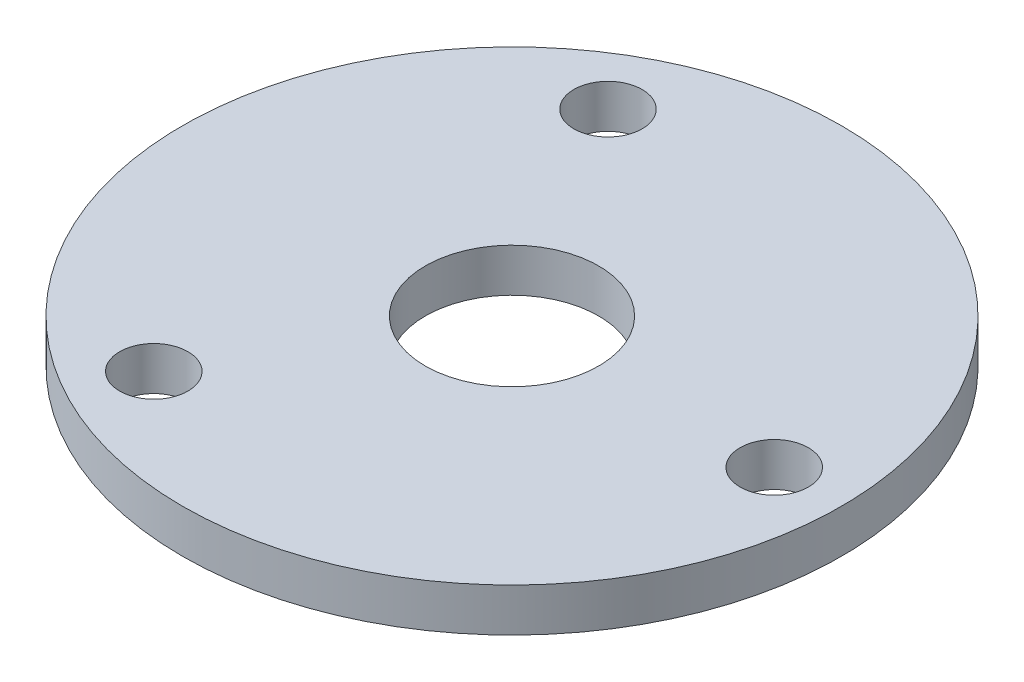
ISO-10303-21;
HEADER;
FILE_DESCRIPTION(('STEP AP214'),'2;1');
FILE_NAME('part.step','',(''),(''),'','','');
FILE_SCHEMA(('AUTOMOTIVE_DESIGN { 1 0 10303 214 1 1 1 1 }'));
ENDSEC;
DATA;
#1=APPLICATION_CONTEXT('core data for automotive mechanical design processes');
#2=APPLICATION_PROTOCOL_DEFINITION('international standard','automotive_design',2000,#1);
#3=PRODUCT_CONTEXT('',#1,'mechanical');
#4=PRODUCT('Part','Part','',(#3));
#5=PRODUCT_RELATED_PRODUCT_CATEGORY('part','',(#4));
#6=PRODUCT_DEFINITION_FORMATION('','',#4);
#7=PRODUCT_DEFINITION_CONTEXT('part definition',#1,'design');
#8=PRODUCT_DEFINITION('design','',#6,#7);
#9=PRODUCT_DEFINITION_SHAPE('','',#8);
#10=(LENGTH_UNIT() NAMED_UNIT(*) SI_UNIT(.MILLI.,.METRE.));
#11=(NAMED_UNIT(*) PLANE_ANGLE_UNIT() SI_UNIT($,.RADIAN.));
#12=(NAMED_UNIT(*) SI_UNIT($,.STERADIAN.) SOLID_ANGLE_UNIT());
#13=UNCERTAINTY_MEASURE_WITH_UNIT(LENGTH_MEASURE(1.E-05),#10,'distance_accuracy_value','');
#14=(GEOMETRIC_REPRESENTATION_CONTEXT(3) GLOBAL_UNCERTAINTY_ASSIGNED_CONTEXT((#13)) GLOBAL_UNIT_ASSIGNED_CONTEXT((#10,
#11,#12)) REPRESENTATION_CONTEXT('',''));
#15=CARTESIAN_POINT('',(0.,0.,0.));
#16=DIRECTION('',(0.,0.,1.));
#17=DIRECTION('',(1.,0.,0.));
#18=AXIS2_PLACEMENT_3D('',#15,#16,#17);
#19=CARTESIAN_POINT('',(0.,3.175,0.));
#20=DIRECTION('',(0.,1.,0.));
#21=DIRECTION('',(0.,0.,1.));
#22=AXIS2_PLACEMENT_3D('',#19,#20,#21);
#23=PLANE('',#22);
#24=CARTESIAN_POINT('',(-9.59999999999985,3.175,16.6276877526613));
#25=DIRECTION('',(0.,1.,0.));
#26=DIRECTION('',(0.,0.,1.));
#27=AXIS2_PLACEMENT_3D('',#24,#25,#26);
#28=CIRCLE('',#27,2.5);
#29=CARTESIAN_POINT('',(-9.59999999999985,3.175,19.1276877526613));
#30=VERTEX_POINT('',#29);
#31=EDGE_CURVE('E61',#30,#30,#28,.T.);
#32=ORIENTED_EDGE('',*,*,#31,.F.);
#33=EDGE_LOOP('',(#32));
#34=FACE_BOUND('',#33,.T.);
#35=CARTESIAN_POINT('',(19.2,3.175,0.));
#36=DIRECTION('',(0.,1.,0.));
#37=DIRECTION('',(0.,0.,1.));
#38=AXIS2_PLACEMENT_3D('',#35,#36,#37);
#39=CIRCLE('',#38,2.5);
#40=CARTESIAN_POINT('',(19.2,3.175,2.5));
#41=VERTEX_POINT('',#40);
#42=EDGE_CURVE('E47',#41,#41,#39,.T.);
#43=ORIENTED_EDGE('',*,*,#42,.F.);
#44=EDGE_LOOP('',(#43));
#45=FACE_BOUND('',#44,.T.);
#46=CARTESIAN_POINT('',(0.,3.175,0.));
#47=DIRECTION('',(0.,1.,0.));
#48=DIRECTION('',(0.,0.,1.));
#49=AXIS2_PLACEMENT_3D('',#46,#47,#48);
#50=CIRCLE('',#49,24.13);
#51=CARTESIAN_POINT('',(0.,3.175,24.13));
#52=VERTEX_POINT('',#51);
#53=EDGE_CURVE('E10',#52,#52,#50,.T.);
#54=ORIENTED_EDGE('',*,*,#53,.T.);
#55=EDGE_LOOP('',(#54));
#56=FACE_BOUND('',#55,.T.);
#57=CARTESIAN_POINT('',(-9.60000000000008,3.175,-16.6276877526612));
#58=DIRECTION('',(0.,1.,0.));
#59=DIRECTION('',(0.,0.,1.));
#60=AXIS2_PLACEMENT_3D('',#57,#58,#59);
#61=CIRCLE('',#60,2.5);
#62=CARTESIAN_POINT('',(-9.60000000000008,3.175,-14.1276877526612));
#63=VERTEX_POINT('',#62);
#64=EDGE_CURVE('E53',#63,#63,#61,.T.);
#65=ORIENTED_EDGE('',*,*,#64,.F.);
#66=EDGE_LOOP('',(#65));
#67=FACE_BOUND('',#66,.T.);
#68=CARTESIAN_POINT('',(0.,3.175,0.));
#69=DIRECTION('',(0.,1.,0.));
#70=DIRECTION('',(0.,0.,1.));
#71=AXIS2_PLACEMENT_3D('',#68,#69,#70);
#72=CIRCLE('',#71,6.35);
#73=CARTESIAN_POINT('',(0.,3.175,6.35));
#74=VERTEX_POINT('',#73);
#75=EDGE_CURVE('E69',#74,#74,#72,.T.);
#76=ORIENTED_EDGE('',*,*,#75,.F.);
#77=EDGE_LOOP('',(#76));
#78=FACE_BOUND('',#77,.T.);
#79=ADVANCED_FACE('F34',(#34,#45,#56,#67,#78),#23,.T.);
#80=CARTESIAN_POINT('',(0.,0.,0.));
#81=DIRECTION('',(0.,1.,0.));
#82=DIRECTION('',(0.,0.,1.));
#83=AXIS2_PLACEMENT_3D('',#80,#81,#82);
#84=PLANE('',#83);
#85=CARTESIAN_POINT('',(0.,0.,0.));
#86=DIRECTION('',(0.,1.,0.));
#87=DIRECTION('',(0.,0.,1.));
#88=AXIS2_PLACEMENT_3D('',#85,#86,#87);
#89=CIRCLE('',#88,24.13);
#90=CARTESIAN_POINT('',(0.,0.,24.13));
#91=VERTEX_POINT('',#90);
#92=EDGE_CURVE('E38',#91,#91,#89,.T.);
#93=ORIENTED_EDGE('',*,*,#92,.F.);
#94=EDGE_LOOP('',(#93));
#95=FACE_BOUND('',#94,.T.);
#96=CARTESIAN_POINT('',(19.2,0.,0.));
#97=DIRECTION('',(0.,1.,0.));
#98=DIRECTION('',(0.,0.,1.));
#99=AXIS2_PLACEMENT_3D('',#96,#97,#98);
#100=CIRCLE('',#99,2.5);
#101=CARTESIAN_POINT('',(19.2,0.,2.5));
#102=VERTEX_POINT('',#101);
#103=EDGE_CURVE('E49',#102,#102,#100,.T.);
#104=ORIENTED_EDGE('',*,*,#103,.T.);
#105=EDGE_LOOP('',(#104));
#106=FACE_BOUND('',#105,.T.);
#107=CARTESIAN_POINT('',(-9.60000000000008,0.,-16.6276877526612));
#108=DIRECTION('',(0.,1.,0.));
#109=DIRECTION('',(0.,0.,1.));
#110=AXIS2_PLACEMENT_3D('',#107,#108,#109);
#111=CIRCLE('',#110,2.5);
#112=CARTESIAN_POINT('',(-9.60000000000008,0.,-14.1276877526612));
#113=VERTEX_POINT('',#112);
#114=EDGE_CURVE('E57',#113,#113,#111,.T.);
#115=ORIENTED_EDGE('',*,*,#114,.T.);
#116=EDGE_LOOP('',(#115));
#117=FACE_BOUND('',#116,.T.);
#118=CARTESIAN_POINT('',(-9.59999999999985,0.,16.6276877526613));
#119=DIRECTION('',(0.,1.,0.));
#120=DIRECTION('',(0.,0.,1.));
#121=AXIS2_PLACEMENT_3D('',#118,#119,#120);
#122=CIRCLE('',#121,2.5);
#123=CARTESIAN_POINT('',(-9.59999999999985,0.,19.1276877526613));
#124=VERTEX_POINT('',#123);
#125=EDGE_CURVE('E65',#124,#124,#122,.T.);
#126=ORIENTED_EDGE('',*,*,#125,.T.);
#127=EDGE_LOOP('',(#126));
#128=FACE_BOUND('',#127,.T.);
#129=CARTESIAN_POINT('',(0.,0.,0.));
#130=DIRECTION('',(0.,1.,0.));
#131=DIRECTION('',(0.,0.,1.));
#132=AXIS2_PLACEMENT_3D('',#129,#130,#131);
#133=CIRCLE('',#132,6.35);
#134=CARTESIAN_POINT('',(0.,0.,6.35));
#135=VERTEX_POINT('',#134);
#136=EDGE_CURVE('E73',#135,#135,#133,.T.);
#137=ORIENTED_EDGE('',*,*,#136,.T.);
#138=EDGE_LOOP('',(#137));
#139=FACE_BOUND('',#138,.T.);
#140=ADVANCED_FACE('F85',(#95,#106,#117,#128,#139),#84,.F.);
#141=CARTESIAN_POINT('',(0.,3.175,0.));
#142=DIRECTION('',(0.,-1.,0.));
#143=DIRECTION('',(0.,0.,-1.));
#144=AXIS2_PLACEMENT_3D('',#141,#142,#143);
#145=CYLINDRICAL_SURFACE('',#144,24.13);
#146=ORIENTED_EDGE('',*,*,#53,.F.);
#147=EDGE_LOOP('',(#146));
#148=FACE_BOUND('',#147,.T.);
#149=ORIENTED_EDGE('',*,*,#92,.T.);
#150=EDGE_LOOP('',(#149));
#151=FACE_BOUND('',#150,.T.);
#152=ADVANCED_FACE('F36',(#148,#151),#145,.T.);
#153=CARTESIAN_POINT('',(19.2,3.175,0.));
#154=DIRECTION('',(0.,-1.,0.));
#155=DIRECTION('',(0.,0.,-1.));
#156=AXIS2_PLACEMENT_3D('',#153,#154,#155);
#157=CYLINDRICAL_SURFACE('',#156,2.5);
#158=ORIENTED_EDGE('',*,*,#42,.T.);
#159=EDGE_LOOP('',(#158));
#160=FACE_BOUND('',#159,.T.);
#161=ORIENTED_EDGE('',*,*,#103,.F.);
#162=EDGE_LOOP('',(#161));
#163=FACE_BOUND('',#162,.T.);
#164=ADVANCED_FACE('F95',(#160,#163),#157,.F.);
#165=CARTESIAN_POINT('',(-9.60000000000008,3.175,-16.6276877526612));
#166=DIRECTION('',(0.,-1.,0.));
#167=DIRECTION('',(0.,0.,-1.));
#168=AXIS2_PLACEMENT_3D('',#165,#166,#167);
#169=CYLINDRICAL_SURFACE('',#168,2.5);
#170=ORIENTED_EDGE('',*,*,#64,.T.);
#171=EDGE_LOOP('',(#170));
#172=FACE_BOUND('',#171,.T.);
#173=ORIENTED_EDGE('',*,*,#114,.F.);
#174=EDGE_LOOP('',(#173));
#175=FACE_BOUND('',#174,.T.);
#176=ADVANCED_FACE('F98',(#172,#175),#169,.F.);
#177=CARTESIAN_POINT('',(-9.59999999999985,3.175,16.6276877526613));
#178=DIRECTION('',(0.,-1.,0.));
#179=DIRECTION('',(0.,0.,-1.));
#180=AXIS2_PLACEMENT_3D('',#177,#178,#179);
#181=CYLINDRICAL_SURFACE('',#180,2.5);
#182=ORIENTED_EDGE('',*,*,#31,.T.);
#183=EDGE_LOOP('',(#182));
#184=FACE_BOUND('',#183,.T.);
#185=ORIENTED_EDGE('',*,*,#125,.F.);
#186=EDGE_LOOP('',(#185));
#187=FACE_BOUND('',#186,.T.);
#188=ADVANCED_FACE('F102',(#184,#187),#181,.F.);
#189=CARTESIAN_POINT('',(0.,3.175,0.));
#190=DIRECTION('',(0.,-1.,0.));
#191=DIRECTION('',(0.,0.,-1.));
#192=AXIS2_PLACEMENT_3D('',#189,#190,#191);
#193=CYLINDRICAL_SURFACE('',#192,6.35);
#194=ORIENTED_EDGE('',*,*,#75,.T.);
#195=EDGE_LOOP('',(#194));
#196=FACE_BOUND('',#195,.T.);
#197=ORIENTED_EDGE('',*,*,#136,.F.);
#198=EDGE_LOOP('',(#197));
#199=FACE_BOUND('',#198,.T.);
#200=ADVANCED_FACE('F81',(#196,#199),#193,.F.);
#201=CLOSED_SHELL('',(#79,#140,#152,#164,#176,#188,#200));
#202=MANIFOLD_SOLID_BREP('B2',#201);
#203=ADVANCED_BREP_SHAPE_REPRESENTATION('',(#18,#202),#14);
#204=SHAPE_DEFINITION_REPRESENTATION(#9,#203);
ENDSEC;
END-ISO-10303-21;
